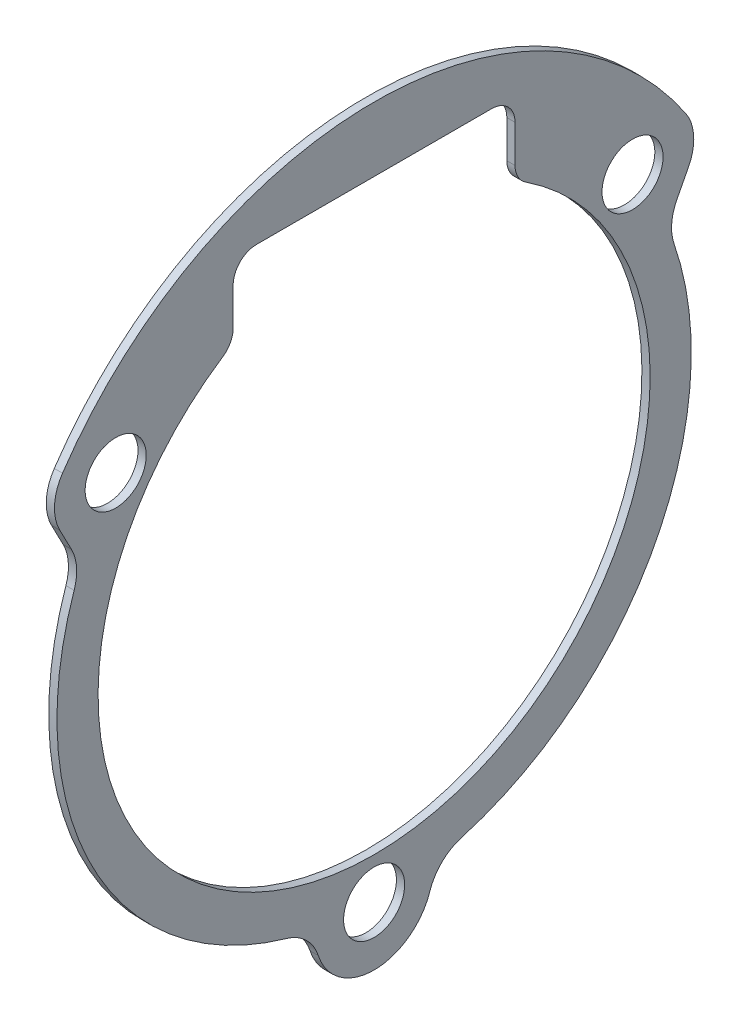
ISO-10303-21;
HEADER;
FILE_DESCRIPTION(('STEP AP214'),'2;1');
FILE_NAME('part.step','',(''),(''),'','','');
FILE_SCHEMA(('AUTOMOTIVE_DESIGN { 1 0 10303 214 1 1 1 1 }'));
ENDSEC;
DATA;
#1=APPLICATION_CONTEXT('core data for automotive mechanical design processes');
#2=APPLICATION_PROTOCOL_DEFINITION('international standard','automotive_design',2000,#1);
#3=PRODUCT_CONTEXT('',#1,'mechanical');
#4=PRODUCT('Part','Part','',(#3));
#5=PRODUCT_RELATED_PRODUCT_CATEGORY('part','',(#4));
#6=PRODUCT_DEFINITION_FORMATION('','',#4);
#7=PRODUCT_DEFINITION_CONTEXT('part definition',#1,'design');
#8=PRODUCT_DEFINITION('design','',#6,#7);
#9=PRODUCT_DEFINITION_SHAPE('','',#8);
#10=(LENGTH_UNIT() NAMED_UNIT(*) SI_UNIT(.MILLI.,.METRE.));
#11=(NAMED_UNIT(*) PLANE_ANGLE_UNIT() SI_UNIT($,.RADIAN.));
#12=(NAMED_UNIT(*) SI_UNIT($,.STERADIAN.) SOLID_ANGLE_UNIT());
#13=UNCERTAINTY_MEASURE_WITH_UNIT(LENGTH_MEASURE(1.E-05),#10,'distance_accuracy_value','');
#14=(GEOMETRIC_REPRESENTATION_CONTEXT(3) GLOBAL_UNCERTAINTY_ASSIGNED_CONTEXT((#13)) GLOBAL_UNIT_ASSIGNED_CONTEXT((#10,
#11,#12)) REPRESENTATION_CONTEXT('',''));
#15=CARTESIAN_POINT('',(0.,0.,0.));
#16=DIRECTION('',(0.,0.,1.));
#17=DIRECTION('',(1.,0.,0.));
#18=AXIS2_PLACEMENT_3D('',#15,#16,#17);
#19=CARTESIAN_POINT('',(0.35,0.,0.));
#20=DIRECTION('',(1.,0.,0.));
#21=DIRECTION('',(0.,0.,-1.));
#22=AXIS2_PLACEMENT_3D('',#19,#20,#21);
#23=PLANE('',#22);
#24=CARTESIAN_POINT('',(0.35,7.82908075667287,11.));
#25=DIRECTION('',(1.,0.,0.));
#26=DIRECTION('',(0.,0.,-1.));
#27=AXIS2_PLACEMENT_3D('',#24,#25,#26);
#28=CIRCLE('',#27,1.3);
#29=CARTESIAN_POINT('',(0.35,7.82908075667287,9.7));
#30=VERTEX_POINT('',#29);
#31=EDGE_CURVE('E610',#30,#30,#28,.T.);
#32=ORIENTED_EDGE('',*,*,#31,.F.);
#33=EDGE_LOOP('',(#32));
#34=FACE_BOUND('',#33,.T.);
#35=CARTESIAN_POINT('',(0.35,0.,0.));
#36=DIRECTION('',(1.,0.,0.));
#37=DIRECTION('',(0.,0.,-1.));
#38=AXIS2_PLACEMENT_3D('',#35,#36,#37);
#39=CIRCLE('',#38,11.75);
#40=CARTESIAN_POINT('',(0.35,9.82076127293642,6.45098039215686));
#41=VERTEX_POINT('',#40);
#42=CARTESIAN_POINT('',(0.35,9.82076127293642,-6.45098039215686));
#43=VERTEX_POINT('',#42);
#44=EDGE_CURVE('E212',#41,#43,#39,.T.);
#45=ORIENTED_EDGE('',*,*,#44,.F.);
#46=CARTESIAN_POINT('',(0.35,10.6565707429736,7.));
#47=DIRECTION('',(-1.,0.,0.));
#48=DIRECTION('',(0.,0.,1.));
#49=AXIS2_PLACEMENT_3D('',#46,#47,#48);
#50=CIRCLE('',#49,1.);
#51=CARTESIAN_POINT('',(0.35,10.6565707429736,6.));
#52=VERTEX_POINT('',#51);
#53=EDGE_CURVE('E183',#52,#41,#50,.T.);
#54=ORIENTED_EDGE('',*,*,#53,.F.);
#55=DIRECTION('',(0.,-1.,0.));
#56=VECTOR('',#55,1.);
#57=CARTESIAN_POINT('',(0.35,12.25,6.));
#58=LINE('',#57,#56);
#59=CARTESIAN_POINT('',(0.35,12.25,6.));
#60=VERTEX_POINT('',#59);
#61=EDGE_CURVE('E224',#60,#52,#58,.T.);
#62=ORIENTED_EDGE('',*,*,#61,.F.);
#63=CARTESIAN_POINT('',(0.35,12.25,5.));
#64=DIRECTION('',(1.,0.,0.));
#65=DIRECTION('',(0.,0.,-1.));
#66=AXIS2_PLACEMENT_3D('',#63,#64,#65);
#67=CIRCLE('',#66,1.);
#68=CARTESIAN_POINT('',(0.35,13.25,5.));
#69=VERTEX_POINT('',#68);
#70=EDGE_CURVE('E222',#69,#60,#67,.T.);
#71=ORIENTED_EDGE('',*,*,#70,.F.);
#72=DIRECTION('',(0.,0.,1.));
#73=VECTOR('',#72,1.);
#74=CARTESIAN_POINT('',(0.35,13.25,5.));
#75=LINE('',#74,#73);
#76=CARTESIAN_POINT('',(0.35,13.25,-5.));
#77=VERTEX_POINT('',#76);
#78=EDGE_CURVE('E220',#77,#69,#75,.T.);
#79=ORIENTED_EDGE('',*,*,#78,.F.);
#80=CARTESIAN_POINT('',(0.35,12.25,-5.));
#81=DIRECTION('',(1.,0.,0.));
#82=DIRECTION('',(0.,0.,-1.));
#83=AXIS2_PLACEMENT_3D('',#80,#81,#82);
#84=CIRCLE('',#83,1.);
#85=CARTESIAN_POINT('',(0.35,12.25,-6.));
#86=VERTEX_POINT('',#85);
#87=EDGE_CURVE('E218',#86,#77,#84,.T.);
#88=ORIENTED_EDGE('',*,*,#87,.F.);
#89=DIRECTION('',(0.,1.,0.));
#90=VECTOR('',#89,1.);
#91=CARTESIAN_POINT('',(0.35,12.25,-6.));
#92=LINE('',#91,#90);
#93=CARTESIAN_POINT('',(0.35,10.6565707429736,-6.));
#94=VERTEX_POINT('',#93);
#95=EDGE_CURVE('E216',#94,#86,#92,.T.);
#96=ORIENTED_EDGE('',*,*,#95,.F.);
#97=CARTESIAN_POINT('',(0.35,10.6565707429736,-7.));
#98=DIRECTION('',(-1.,0.,0.));
#99=DIRECTION('',(0.,0.,1.));
#100=AXIS2_PLACEMENT_3D('',#97,#98,#99);
#101=CIRCLE('',#100,1.);
#102=EDGE_CURVE('E214',#43,#94,#101,.T.);
#103=ORIENTED_EDGE('',*,*,#102,.F.);
#104=EDGE_LOOP('',(#45,#54,#62,#71,#79,#88,#96,#103));
#105=FACE_BOUND('',#104,.T.);
#106=CARTESIAN_POINT('',(0.35,0.,0.));
#107=DIRECTION('',(1.,0.,0.));
#108=DIRECTION('',(0.,0.,-1.));
#109=AXIS2_PLACEMENT_3D('',#106,#107,#108);
#110=CIRCLE('',#109,13.5);
#111=CARTESIAN_POINT('',(0.35,-12.9756578800261,-3.72589621172095));
#112=VERTEX_POINT('',#111);
#113=CARTESIAN_POINT('',(0.35,4.38237926775433,-12.7688978362879));
#114=VERTEX_POINT('',#113);
#115=EDGE_CURVE('E262',#112,#114,#110,.T.);
#116=ORIENTED_EDGE('',*,*,#115,.T.);
#117=CARTESIAN_POINT('',(0.35,5.03162064075497,-14.6605864046268));
#118=DIRECTION('',(-1.,0.,0.));
#119=DIRECTION('',(0.,0.,1.));
#120=AXIS2_PLACEMENT_3D('',#117,#118,#119);
#121=CIRCLE('',#120,2.);
#122=CARTESIAN_POINT('',(0.35,5.95357068977068,-12.8857601857761));
#123=VERTEX_POINT('',#122);
#124=EDGE_CURVE('E265',#114,#123,#121,.T.);
#125=ORIENTED_EDGE('',*,*,#124,.T.);
#126=DIRECTION('',(0.,0.887413109425359,-0.460975024507854));
#127=VECTOR('',#126,1.);
#128=CARTESIAN_POINT('',(0.35,5.95357068977068,-12.8857601857761));
#129=LINE('',#128,#127);
#130=CARTESIAN_POINT('',(0.35,6.90713070765717,-13.3810958394263));
#131=VERTEX_POINT('',#130);
#132=EDGE_CURVE('E267',#123,#131,#129,.T.);
#133=ORIENTED_EDGE('',*,*,#132,.T.);
#134=CARTESIAN_POINT('',(0.35,7.82908075667287,-11.6062696205755));
#135=DIRECTION('',(1.,0.,0.));
#136=DIRECTION('',(0.,0.,1.));
#137=AXIS2_PLACEMENT_3D('',#134,#135,#136);
#138=CIRCLE('',#137,2.);
#139=CARTESIAN_POINT('',(0.35,8.947520864769,-13.2643081378006));
#140=VERTEX_POINT('',#139);
#141=EDGE_CURVE('E269',#131,#140,#138,.T.);
#142=ORIENTED_EDGE('',*,*,#141,.T.);
#143=CARTESIAN_POINT('',(0.35,0.,0.));
#144=DIRECTION('',(1.,0.,0.));
#145=DIRECTION('',(0.,0.,-1.));
#146=AXIS2_PLACEMENT_3D('',#143,#144,#145);
#147=CIRCLE('',#146,16.);
#148=CARTESIAN_POINT('',(0.35,8.947520864769,13.2643081378006));
#149=VERTEX_POINT('',#148);
#150=EDGE_CURVE('E271',#140,#149,#147,.T.);
#151=ORIENTED_EDGE('',*,*,#150,.T.);
#152=CARTESIAN_POINT('',(0.35,7.82908075667287,11.6062696205755));
#153=DIRECTION('',(1.,0.,0.));
#154=DIRECTION('',(0.,0.,1.));
#155=AXIS2_PLACEMENT_3D('',#152,#153,#154);
#156=CIRCLE('',#155,2.);
#157=CARTESIAN_POINT('',(0.35,6.90713070765717,13.3810958394263));
#158=VERTEX_POINT('',#157);
#159=EDGE_CURVE('E273',#149,#158,#156,.T.);
#160=ORIENTED_EDGE('',*,*,#159,.T.);
#161=DIRECTION('',(0.,-0.887413109425361,-0.46097502450785));
#162=VECTOR('',#161,1.);
#163=CARTESIAN_POINT('',(0.35,5.95357068977068,12.8857601857761));
#164=LINE('',#163,#162);
#165=CARTESIAN_POINT('',(0.35,5.95357068977068,12.8857601857761));
#166=VERTEX_POINT('',#165);
#167=EDGE_CURVE('E275',#158,#166,#164,.T.);
#168=ORIENTED_EDGE('',*,*,#167,.T.);
#169=CARTESIAN_POINT('',(0.35,5.03162064075497,14.6605864046268));
#170=DIRECTION('',(-1.,0.,0.));
#171=DIRECTION('',(0.,0.,-1.));
#172=AXIS2_PLACEMENT_3D('',#169,#170,#171);
#173=CIRCLE('',#172,2.);
#174=CARTESIAN_POINT('',(0.35,4.38237926775433,12.7688978362879));
#175=VERTEX_POINT('',#174);
#176=EDGE_CURVE('E277',#166,#175,#173,.T.);
#177=ORIENTED_EDGE('',*,*,#176,.T.);
#178=CARTESIAN_POINT('',(0.35,0.,0.));
#179=DIRECTION('',(1.,0.,0.));
#180=DIRECTION('',(0.,0.,-1.));
#181=AXIS2_PLACEMENT_3D('',#178,#179,#180);
#182=CIRCLE('',#181,13.5);
#183=CARTESIAN_POINT('',(0.35,-12.9756578800261,3.72589621172096));
#184=VERTEX_POINT('',#183);
#185=EDGE_CURVE('E279',#175,#184,#182,.T.);
#186=ORIENTED_EDGE('',*,*,#185,.T.);
#187=CARTESIAN_POINT('',(0.35,-14.8979775659559,4.27788083567961));
#188=DIRECTION('',(-1.,0.,0.));
#189=DIRECTION('',(0.,0.,-1.));
#190=AXIS2_PLACEMENT_3D('',#187,#188,#189);
#191=CIRCLE('',#190,2.);
#192=CARTESIAN_POINT('',(0.35,-14.2773867593216,2.37660046426645));
#193=VERTEX_POINT('',#192);
#194=EDGE_CURVE('E281',#184,#193,#191,.T.);
#195=ORIENTED_EDGE('',*,*,#194,.T.);
#196=CARTESIAN_POINT('',(0.35,-13.5016482510287,0.));
#197=DIRECTION('',(1.,0.,0.));
#198=DIRECTION('',(0.,0.,-1.));
#199=AXIS2_PLACEMENT_3D('',#196,#197,#198);
#200=CIRCLE('',#199,2.5);
#201=CARTESIAN_POINT('',(0.35,-14.2773867593216,-2.37660046426645));
#202=VERTEX_POINT('',#201);
#203=EDGE_CURVE('E283',#193,#202,#200,.T.);
#204=ORIENTED_EDGE('',*,*,#203,.T.);
#205=CARTESIAN_POINT('',(0.35,-14.8979775659559,-4.27788083567961));
#206=DIRECTION('',(-1.,0.,0.));
#207=DIRECTION('',(0.,0.,-1.));
#208=AXIS2_PLACEMENT_3D('',#205,#206,#207);
#209=CIRCLE('',#208,2.);
#210=EDGE_CURVE('E285',#202,#112,#209,.T.);
#211=ORIENTED_EDGE('',*,*,#210,.T.);
#212=EDGE_LOOP('',(#116,#125,#133,#142,#151,#160,#168,#177,#186,#195,#204,#211));
#213=FACE_BOUND('',#212,.T.);
#214=CARTESIAN_POINT('',(0.35,7.82908075667287,-11.));
#215=DIRECTION('',(1.,0.,0.));
#216=DIRECTION('',(0.,0.,-1.));
#217=AXIS2_PLACEMENT_3D('',#214,#215,#216);
#218=CIRCLE('',#217,1.3);
#219=CARTESIAN_POINT('',(0.35,7.82908075667287,-12.3));
#220=VERTEX_POINT('',#219);
#221=EDGE_CURVE('E191',#220,#220,#218,.T.);
#222=ORIENTED_EDGE('',*,*,#221,.F.);
#223=EDGE_LOOP('',(#222));
#224=FACE_BOUND('',#223,.T.);
#225=CARTESIAN_POINT('',(0.35,-13.5016482510287,0.));
#226=DIRECTION('',(1.,0.,0.));
#227=DIRECTION('',(0.,0.,-1.));
#228=AXIS2_PLACEMENT_3D('',#225,#226,#227);
#229=CIRCLE('',#228,1.3);
#230=CARTESIAN_POINT('',(0.35,-13.5016482510287,-1.3));
#231=VERTEX_POINT('',#230);
#232=EDGE_CURVE('E599',#231,#231,#229,.T.);
#233=ORIENTED_EDGE('',*,*,#232,.F.);
#234=EDGE_LOOP('',(#233));
#235=FACE_BOUND('',#234,.T.);
#236=ADVANCED_FACE('F31',(#34,#105,#213,#224,#235),#23,.T.);
#237=CARTESIAN_POINT('',(0.,0.,0.));
#238=DIRECTION('',(1.,0.,0.));
#239=DIRECTION('',(0.,0.,-1.));
#240=AXIS2_PLACEMENT_3D('',#237,#238,#239);
#241=PLANE('',#240);
#242=CARTESIAN_POINT('',(0.,7.82908075667287,11.));
#243=DIRECTION('',(1.,0.,0.));
#244=DIRECTION('',(0.,0.,-1.));
#245=AXIS2_PLACEMENT_3D('',#242,#243,#244);
#246=CIRCLE('',#245,1.3);
#247=CARTESIAN_POINT('',(0.,7.82908075667287,9.7));
#248=VERTEX_POINT('',#247);
#249=EDGE_CURVE('E605',#248,#248,#246,.T.);
#250=ORIENTED_EDGE('',*,*,#249,.T.);
#251=EDGE_LOOP('',(#250));
#252=FACE_BOUND('',#251,.T.);
#253=CARTESIAN_POINT('',(0.,10.6565707429736,7.));
#254=DIRECTION('',(-1.,0.,0.));
#255=DIRECTION('',(0.,0.,1.));
#256=AXIS2_PLACEMENT_3D('',#253,#254,#255);
#257=CIRCLE('',#256,1.);
#258=CARTESIAN_POINT('',(0.,10.6565707429736,6.));
#259=VERTEX_POINT('',#258);
#260=CARTESIAN_POINT('',(0.,9.82076127293642,6.45098039215686));
#261=VERTEX_POINT('',#260);
#262=EDGE_CURVE('E54',#259,#261,#257,.T.);
#263=ORIENTED_EDGE('',*,*,#262,.T.);
#264=CARTESIAN_POINT('',(0.,0.,0.));
#265=DIRECTION('',(1.,0.,0.));
#266=DIRECTION('',(0.,0.,-1.));
#267=AXIS2_PLACEMENT_3D('',#264,#265,#266);
#268=CIRCLE('',#267,11.75);
#269=CARTESIAN_POINT('',(0.,9.82076127293642,-6.45098039215686));
#270=VERTEX_POINT('',#269);
#271=EDGE_CURVE('E170',#261,#270,#268,.T.);
#272=ORIENTED_EDGE('',*,*,#271,.T.);
#273=CARTESIAN_POINT('',(0.,10.6565707429736,-7.));
#274=DIRECTION('',(-1.,0.,0.));
#275=DIRECTION('',(0.,0.,1.));
#276=AXIS2_PLACEMENT_3D('',#273,#274,#275);
#277=CIRCLE('',#276,1.);
#278=CARTESIAN_POINT('',(0.,10.6565707429736,-6.));
#279=VERTEX_POINT('',#278);
#280=EDGE_CURVE('E179',#270,#279,#277,.T.);
#281=ORIENTED_EDGE('',*,*,#280,.T.);
#282=DIRECTION('',(0.,1.,0.));
#283=VECTOR('',#282,1.);
#284=CARTESIAN_POINT('',(0.,12.25,-6.));
#285=LINE('',#284,#283);
#286=CARTESIAN_POINT('',(0.,12.25,-6.));
#287=VERTEX_POINT('',#286);
#288=EDGE_CURVE('E199',#279,#287,#285,.T.);
#289=ORIENTED_EDGE('',*,*,#288,.T.);
#290=CARTESIAN_POINT('',(0.,12.25,-5.));
#291=DIRECTION('',(1.,0.,0.));
#292=DIRECTION('',(0.,0.,-1.));
#293=AXIS2_PLACEMENT_3D('',#290,#291,#292);
#294=CIRCLE('',#293,1.);
#295=CARTESIAN_POINT('',(0.,13.25,-5.));
#296=VERTEX_POINT('',#295);
#297=EDGE_CURVE('E202',#287,#296,#294,.T.);
#298=ORIENTED_EDGE('',*,*,#297,.T.);
#299=DIRECTION('',(0.,0.,1.));
#300=VECTOR('',#299,1.);
#301=CARTESIAN_POINT('',(0.,13.25,5.));
#302=LINE('',#301,#300);
#303=CARTESIAN_POINT('',(0.,13.25,5.));
#304=VERTEX_POINT('',#303);
#305=EDGE_CURVE('E205',#296,#304,#302,.T.);
#306=ORIENTED_EDGE('',*,*,#305,.T.);
#307=CARTESIAN_POINT('',(0.,12.25,5.));
#308=DIRECTION('',(1.,0.,0.));
#309=DIRECTION('',(0.,0.,-1.));
#310=AXIS2_PLACEMENT_3D('',#307,#308,#309);
#311=CIRCLE('',#310,1.);
#312=CARTESIAN_POINT('',(0.,12.25,6.));
#313=VERTEX_POINT('',#312);
#314=EDGE_CURVE('E208',#304,#313,#311,.T.);
#315=ORIENTED_EDGE('',*,*,#314,.T.);
#316=DIRECTION('',(0.,-1.,0.));
#317=VECTOR('',#316,1.);
#318=CARTESIAN_POINT('',(0.,12.25,6.));
#319=LINE('',#318,#317);
#320=EDGE_CURVE('E190',#313,#259,#319,.T.);
#321=ORIENTED_EDGE('',*,*,#320,.T.);
#322=EDGE_LOOP('',(#263,#272,#281,#289,#298,#306,#315,#321));
#323=FACE_BOUND('',#322,.T.);
#324=CARTESIAN_POINT('',(0.,0.,0.));
#325=DIRECTION('',(1.,0.,0.));
#326=DIRECTION('',(0.,0.,-1.));
#327=AXIS2_PLACEMENT_3D('',#324,#325,#326);
#328=CIRCLE('',#327,13.5);
#329=CARTESIAN_POINT('',(0.,-12.9756578800261,-3.72589621172095));
#330=VERTEX_POINT('',#329);
#331=CARTESIAN_POINT('',(0.,4.38237926775433,-12.7688978362879));
#332=VERTEX_POINT('',#331);
#333=EDGE_CURVE('E184',#330,#332,#328,.T.);
#334=ORIENTED_EDGE('',*,*,#333,.F.);
#335=CARTESIAN_POINT('',(0.,-14.8979775659559,-4.27788083567961));
#336=DIRECTION('',(-1.,0.,0.));
#337=DIRECTION('',(0.,0.,-1.));
#338=AXIS2_PLACEMENT_3D('',#335,#336,#337);
#339=CIRCLE('',#338,2.);
#340=CARTESIAN_POINT('',(0.,-14.2773867593216,-2.37660046426645));
#341=VERTEX_POINT('',#340);
#342=EDGE_CURVE('E260',#341,#330,#339,.T.);
#343=ORIENTED_EDGE('',*,*,#342,.F.);
#344=CARTESIAN_POINT('',(0.,-13.5016482510287,0.));
#345=DIRECTION('',(1.,0.,0.));
#346=DIRECTION('',(0.,0.,-1.));
#347=AXIS2_PLACEMENT_3D('',#344,#345,#346);
#348=CIRCLE('',#347,2.5);
#349=CARTESIAN_POINT('',(0.,-14.2773867593216,2.37660046426645));
#350=VERTEX_POINT('',#349);
#351=EDGE_CURVE('E258',#350,#341,#348,.T.);
#352=ORIENTED_EDGE('',*,*,#351,.F.);
#353=CARTESIAN_POINT('',(0.,-14.8979775659559,4.27788083567961));
#354=DIRECTION('',(-1.,0.,0.));
#355=DIRECTION('',(0.,0.,-1.));
#356=AXIS2_PLACEMENT_3D('',#353,#354,#355);
#357=CIRCLE('',#356,2.);
#358=CARTESIAN_POINT('',(0.,-12.9756578800261,3.72589621172096));
#359=VERTEX_POINT('',#358);
#360=EDGE_CURVE('E256',#359,#350,#357,.T.);
#361=ORIENTED_EDGE('',*,*,#360,.F.);
#362=CARTESIAN_POINT('',(0.,0.,0.));
#363=DIRECTION('',(1.,0.,0.));
#364=DIRECTION('',(0.,0.,-1.));
#365=AXIS2_PLACEMENT_3D('',#362,#363,#364);
#366=CIRCLE('',#365,13.5);
#367=CARTESIAN_POINT('',(0.,4.38237926775433,12.7688978362879));
#368=VERTEX_POINT('',#367);
#369=EDGE_CURVE('E254',#368,#359,#366,.T.);
#370=ORIENTED_EDGE('',*,*,#369,.F.);
#371=CARTESIAN_POINT('',(0.,5.03162064075497,14.6605864046268));
#372=DIRECTION('',(-1.,0.,0.));
#373=DIRECTION('',(0.,0.,-1.));
#374=AXIS2_PLACEMENT_3D('',#371,#372,#373);
#375=CIRCLE('',#374,2.);
#376=CARTESIAN_POINT('',(0.,5.95357068977068,12.8857601857761));
#377=VERTEX_POINT('',#376);
#378=EDGE_CURVE('E252',#377,#368,#375,.T.);
#379=ORIENTED_EDGE('',*,*,#378,.F.);
#380=DIRECTION('',(0.,-0.887413109425361,-0.46097502450785));
#381=VECTOR('',#380,1.);
#382=CARTESIAN_POINT('',(0.,5.95357068977068,12.8857601857761));
#383=LINE('',#382,#381);
#384=CARTESIAN_POINT('',(0.,6.90713070765717,13.3810958394263));
#385=VERTEX_POINT('',#384);
#386=EDGE_CURVE('E250',#385,#377,#383,.T.);
#387=ORIENTED_EDGE('',*,*,#386,.F.);
#388=CARTESIAN_POINT('',(0.,7.82908075667287,11.6062696205755));
#389=DIRECTION('',(1.,0.,0.));
#390=DIRECTION('',(0.,0.,1.));
#391=AXIS2_PLACEMENT_3D('',#388,#389,#390);
#392=CIRCLE('',#391,2.);
#393=CARTESIAN_POINT('',(0.,8.947520864769,13.2643081378006));
#394=VERTEX_POINT('',#393);
#395=EDGE_CURVE('E248',#394,#385,#392,.T.);
#396=ORIENTED_EDGE('',*,*,#395,.F.);
#397=CARTESIAN_POINT('',(0.,0.,0.));
#398=DIRECTION('',(1.,0.,0.));
#399=DIRECTION('',(0.,0.,-1.));
#400=AXIS2_PLACEMENT_3D('',#397,#398,#399);
#401=CIRCLE('',#400,16.);
#402=CARTESIAN_POINT('',(0.,8.947520864769,-13.2643081378006));
#403=VERTEX_POINT('',#402);
#404=EDGE_CURVE('E246',#403,#394,#401,.T.);
#405=ORIENTED_EDGE('',*,*,#404,.F.);
#406=CARTESIAN_POINT('',(0.,7.82908075667287,-11.6062696205755));
#407=DIRECTION('',(1.,0.,0.));
#408=DIRECTION('',(0.,0.,1.));
#409=AXIS2_PLACEMENT_3D('',#406,#407,#408);
#410=CIRCLE('',#409,2.);
#411=CARTESIAN_POINT('',(0.,6.90713070765717,-13.3810958394263));
#412=VERTEX_POINT('',#411);
#413=EDGE_CURVE('E244',#412,#403,#410,.T.);
#414=ORIENTED_EDGE('',*,*,#413,.F.);
#415=DIRECTION('',(0.,0.887413109425359,-0.460975024507854));
#416=VECTOR('',#415,1.);
#417=CARTESIAN_POINT('',(0.,5.95357068977068,-12.8857601857761));
#418=LINE('',#417,#416);
#419=CARTESIAN_POINT('',(0.,5.95357068977068,-12.8857601857761));
#420=VERTEX_POINT('',#419);
#421=EDGE_CURVE('E242',#420,#412,#418,.T.);
#422=ORIENTED_EDGE('',*,*,#421,.F.);
#423=CARTESIAN_POINT('',(0.,5.03162064075497,-14.6605864046268));
#424=DIRECTION('',(-1.,0.,0.));
#425=DIRECTION('',(0.,0.,1.));
#426=AXIS2_PLACEMENT_3D('',#423,#424,#425);
#427=CIRCLE('',#426,2.);
#428=EDGE_CURVE('E240',#332,#420,#427,.T.);
#429=ORIENTED_EDGE('',*,*,#428,.F.);
#430=EDGE_LOOP('',(#334,#343,#352,#361,#370,#379,#387,#396,#405,#414,#422,#429));
#431=FACE_BOUND('',#430,.T.);
#432=CARTESIAN_POINT('',(0.,7.82908075667287,-11.));
#433=DIRECTION('',(1.,0.,0.));
#434=DIRECTION('',(0.,0.,-1.));
#435=AXIS2_PLACEMENT_3D('',#432,#433,#434);
#436=CIRCLE('',#435,1.3);
#437=CARTESIAN_POINT('',(0.,7.82908075667287,-12.3));
#438=VERTEX_POINT('',#437);
#439=EDGE_CURVE('E194',#438,#438,#436,.T.);
#440=ORIENTED_EDGE('',*,*,#439,.T.);
#441=EDGE_LOOP('',(#440));
#442=FACE_BOUND('',#441,.T.);
#443=CARTESIAN_POINT('',(0.,-13.5016482510287,0.));
#444=DIRECTION('',(1.,0.,0.));
#445=DIRECTION('',(0.,0.,-1.));
#446=AXIS2_PLACEMENT_3D('',#443,#444,#445);
#447=CIRCLE('',#446,1.3);
#448=CARTESIAN_POINT('',(0.,-13.5016482510287,-1.3));
#449=VERTEX_POINT('',#448);
#450=EDGE_CURVE('E602',#449,#449,#447,.T.);
#451=ORIENTED_EDGE('',*,*,#450,.T.);
#452=EDGE_LOOP('',(#451));
#453=FACE_BOUND('',#452,.T.);
#454=ADVANCED_FACE('F187',(#252,#323,#431,#442,#453),#241,.F.);
#455=CARTESIAN_POINT('',(0.35,0.,0.));
#456=DIRECTION('',(-1.,0.,0.));
#457=DIRECTION('',(0.,0.,1.));
#458=AXIS2_PLACEMENT_3D('',#455,#456,#457);
#459=CYLINDRICAL_SURFACE('',#458,13.5);
#460=ORIENTED_EDGE('',*,*,#333,.T.);
#461=DIRECTION('',(-1.,0.,0.));
#462=VECTOR('',#461,1.);
#463=CARTESIAN_POINT('',(0.35,4.38237926775433,-12.7688978362879));
#464=LINE('',#463,#462);
#465=EDGE_CURVE('E11',#114,#332,#464,.T.);
#466=ORIENTED_EDGE('',*,*,#465,.F.);
#467=ORIENTED_EDGE('',*,*,#115,.F.);
#468=DIRECTION('',(-1.,0.,0.));
#469=VECTOR('',#468,1.);
#470=CARTESIAN_POINT('',(0.35,-12.9756578800261,-3.72589621172095));
#471=LINE('',#470,#469);
#472=EDGE_CURVE('E287',#112,#330,#471,.T.);
#473=ORIENTED_EDGE('',*,*,#472,.T.);
#474=EDGE_LOOP('',(#460,#466,#467,#473));
#475=FACE_BOUND('',#474,.T.);
#476=ADVANCED_FACE('F33',(#475),#459,.T.);
#477=CARTESIAN_POINT('',(0.35,5.03162064075497,-14.6605864046268));
#478=DIRECTION('',(-1.,0.,0.));
#479=DIRECTION('',(0.,0.,1.));
#480=AXIS2_PLACEMENT_3D('',#477,#478,#479);
#481=CYLINDRICAL_SURFACE('',#480,2.);
#482=ORIENTED_EDGE('',*,*,#428,.T.);
#483=DIRECTION('',(-1.,0.,0.));
#484=VECTOR('',#483,1.);
#485=CARTESIAN_POINT('',(0.35,5.95357068977068,-12.8857601857761));
#486=LINE('',#485,#484);
#487=EDGE_CURVE('E39',#123,#420,#486,.T.);
#488=ORIENTED_EDGE('',*,*,#487,.F.);
#489=ORIENTED_EDGE('',*,*,#124,.F.);
#490=ORIENTED_EDGE('',*,*,#465,.T.);
#491=EDGE_LOOP('',(#482,#488,#489,#490));
#492=FACE_BOUND('',#491,.T.);
#493=ADVANCED_FACE('F343',(#492),#481,.F.);
#494=CARTESIAN_POINT('',(0.35,5.95357068977068,-12.8857601857761));
#495=DIRECTION('',(0.,0.460975024507854,0.887413109425359));
#496=DIRECTION('',(0.,-0.887413109425359,0.460975024507854));
#497=AXIS2_PLACEMENT_3D('',#494,#495,#496);
#498=PLANE('',#497);
#499=ORIENTED_EDGE('',*,*,#421,.T.);
#500=DIRECTION('',(-1.,0.,0.));
#501=VECTOR('',#500,1.);
#502=CARTESIAN_POINT('',(0.35,6.90713070765717,-13.3810958394263));
#503=LINE('',#502,#501);
#504=EDGE_CURVE('E314',#131,#412,#503,.T.);
#505=ORIENTED_EDGE('',*,*,#504,.F.);
#506=ORIENTED_EDGE('',*,*,#132,.F.);
#507=ORIENTED_EDGE('',*,*,#487,.T.);
#508=EDGE_LOOP('',(#499,#505,#506,#507));
#509=FACE_BOUND('',#508,.T.);
#510=ADVANCED_FACE('F321',(#509),#498,.F.);
#511=CARTESIAN_POINT('',(0.35,7.82908075667287,-11.6062696205755));
#512=DIRECTION('',(-1.,0.,0.));
#513=DIRECTION('',(0.,0.,1.));
#514=AXIS2_PLACEMENT_3D('',#511,#512,#513);
#515=CYLINDRICAL_SURFACE('',#514,2.);
#516=ORIENTED_EDGE('',*,*,#413,.T.);
#517=DIRECTION('',(-1.,0.,0.));
#518=VECTOR('',#517,1.);
#519=CARTESIAN_POINT('',(0.35,8.947520864769,-13.2643081378006));
#520=LINE('',#519,#518);
#521=EDGE_CURVE('E311',#140,#403,#520,.T.);
#522=ORIENTED_EDGE('',*,*,#521,.F.);
#523=ORIENTED_EDGE('',*,*,#141,.F.);
#524=ORIENTED_EDGE('',*,*,#504,.T.);
#525=EDGE_LOOP('',(#516,#522,#523,#524));
#526=FACE_BOUND('',#525,.T.);
#527=ADVANCED_FACE('F331',(#526),#515,.T.);
#528=CARTESIAN_POINT('',(0.35,0.,0.));
#529=DIRECTION('',(-1.,0.,0.));
#530=DIRECTION('',(0.,0.,1.));
#531=AXIS2_PLACEMENT_3D('',#528,#529,#530);
#532=CYLINDRICAL_SURFACE('',#531,16.);
#533=ORIENTED_EDGE('',*,*,#404,.T.);
#534=DIRECTION('',(-1.,0.,0.));
#535=VECTOR('',#534,1.);
#536=CARTESIAN_POINT('',(0.35,8.947520864769,13.2643081378006));
#537=LINE('',#536,#535);
#538=EDGE_CURVE('E308',#149,#394,#537,.T.);
#539=ORIENTED_EDGE('',*,*,#538,.F.);
#540=ORIENTED_EDGE('',*,*,#150,.F.);
#541=ORIENTED_EDGE('',*,*,#521,.T.);
#542=EDGE_LOOP('',(#533,#539,#540,#541));
#543=FACE_BOUND('',#542,.T.);
#544=ADVANCED_FACE('F335',(#543),#532,.T.);
#545=CARTESIAN_POINT('',(0.35,7.82908075667287,11.6062696205755));
#546=DIRECTION('',(-1.,0.,0.));
#547=DIRECTION('',(0.,0.,1.));
#548=AXIS2_PLACEMENT_3D('',#545,#546,#547);
#549=CYLINDRICAL_SURFACE('',#548,2.);
#550=ORIENTED_EDGE('',*,*,#395,.T.);
#551=DIRECTION('',(-1.,0.,0.));
#552=VECTOR('',#551,1.);
#553=CARTESIAN_POINT('',(0.35,6.90713070765717,13.3810958394263));
#554=LINE('',#553,#552);
#555=EDGE_CURVE('E305',#158,#385,#554,.T.);
#556=ORIENTED_EDGE('',*,*,#555,.F.);
#557=ORIENTED_EDGE('',*,*,#159,.F.);
#558=ORIENTED_EDGE('',*,*,#538,.T.);
#559=EDGE_LOOP('',(#550,#556,#557,#558));
#560=FACE_BOUND('',#559,.T.);
#561=ADVANCED_FACE('F376',(#560),#549,.T.);
#562=CARTESIAN_POINT('',(0.35,5.95357068977068,12.8857601857761));
#563=DIRECTION('',(0.,0.460975024507849,-0.887413109425361));
#564=DIRECTION('',(0.,0.887413109425361,0.460975024507849));
#565=AXIS2_PLACEMENT_3D('',#562,#563,#564);
#566=PLANE('',#565);
#567=ORIENTED_EDGE('',*,*,#386,.T.);
#568=DIRECTION('',(-1.,0.,0.));
#569=VECTOR('',#568,1.);
#570=CARTESIAN_POINT('',(0.35,5.95357068977068,12.8857601857761));
#571=LINE('',#570,#569);
#572=EDGE_CURVE('E302',#166,#377,#571,.T.);
#573=ORIENTED_EDGE('',*,*,#572,.F.);
#574=ORIENTED_EDGE('',*,*,#167,.F.);
#575=ORIENTED_EDGE('',*,*,#555,.T.);
#576=EDGE_LOOP('',(#567,#573,#574,#575));
#577=FACE_BOUND('',#576,.T.);
#578=ADVANCED_FACE('F374',(#577),#566,.F.);
#579=CARTESIAN_POINT('',(0.35,5.03162064075497,14.6605864046268));
#580=DIRECTION('',(-1.,0.,0.));
#581=DIRECTION('',(0.,0.,1.));
#582=AXIS2_PLACEMENT_3D('',#579,#580,#581);
#583=CYLINDRICAL_SURFACE('',#582,2.);
#584=ORIENTED_EDGE('',*,*,#378,.T.);
#585=DIRECTION('',(-1.,0.,0.));
#586=VECTOR('',#585,1.);
#587=CARTESIAN_POINT('',(0.35,4.38237926775433,12.7688978362879));
#588=LINE('',#587,#586);
#589=EDGE_CURVE('E299',#175,#368,#588,.T.);
#590=ORIENTED_EDGE('',*,*,#589,.F.);
#591=ORIENTED_EDGE('',*,*,#176,.F.);
#592=ORIENTED_EDGE('',*,*,#572,.T.);
#593=EDGE_LOOP('',(#584,#590,#591,#592));
#594=FACE_BOUND('',#593,.T.);
#595=ADVANCED_FACE('F370',(#594),#583,.F.);
#596=CARTESIAN_POINT('',(0.35,0.,0.));
#597=DIRECTION('',(-1.,0.,0.));
#598=DIRECTION('',(0.,0.,1.));
#599=AXIS2_PLACEMENT_3D('',#596,#597,#598);
#600=CYLINDRICAL_SURFACE('',#599,13.5);
#601=ORIENTED_EDGE('',*,*,#369,.T.);
#602=DIRECTION('',(-1.,0.,0.));
#603=VECTOR('',#602,1.);
#604=CARTESIAN_POINT('',(0.35,-12.9756578800261,3.72589621172096));
#605=LINE('',#604,#603);
#606=EDGE_CURVE('E296',#184,#359,#605,.T.);
#607=ORIENTED_EDGE('',*,*,#606,.F.);
#608=ORIENTED_EDGE('',*,*,#185,.F.);
#609=ORIENTED_EDGE('',*,*,#589,.T.);
#610=EDGE_LOOP('',(#601,#607,#608,#609));
#611=FACE_BOUND('',#610,.T.);
#612=ADVANCED_FACE('F365',(#611),#600,.T.);
#613=CARTESIAN_POINT('',(0.35,-14.8979775659559,4.27788083567961));
#614=DIRECTION('',(-1.,0.,0.));
#615=DIRECTION('',(0.,0.,1.));
#616=AXIS2_PLACEMENT_3D('',#613,#614,#615);
#617=CYLINDRICAL_SURFACE('',#616,2.);
#618=ORIENTED_EDGE('',*,*,#360,.T.);
#619=DIRECTION('',(-1.,0.,0.));
#620=VECTOR('',#619,1.);
#621=CARTESIAN_POINT('',(0.35,-14.2773867593216,2.37660046426645));
#622=LINE('',#621,#620);
#623=EDGE_CURVE('E293',#193,#350,#622,.T.);
#624=ORIENTED_EDGE('',*,*,#623,.F.);
#625=ORIENTED_EDGE('',*,*,#194,.F.);
#626=ORIENTED_EDGE('',*,*,#606,.T.);
#627=EDGE_LOOP('',(#618,#624,#625,#626));
#628=FACE_BOUND('',#627,.T.);
#629=ADVANCED_FACE('F359',(#628),#617,.F.);
#630=CARTESIAN_POINT('',(0.35,-13.5016482510287,0.));
#631=DIRECTION('',(-1.,0.,0.));
#632=DIRECTION('',(0.,0.,1.));
#633=AXIS2_PLACEMENT_3D('',#630,#631,#632);
#634=CYLINDRICAL_SURFACE('',#633,2.5);
#635=ORIENTED_EDGE('',*,*,#351,.T.);
#636=DIRECTION('',(-1.,0.,0.));
#637=VECTOR('',#636,1.);
#638=CARTESIAN_POINT('',(0.35,-14.2773867593216,-2.37660046426645));
#639=LINE('',#638,#637);
#640=EDGE_CURVE('E290',#202,#341,#639,.T.);
#641=ORIENTED_EDGE('',*,*,#640,.F.);
#642=ORIENTED_EDGE('',*,*,#203,.F.);
#643=ORIENTED_EDGE('',*,*,#623,.T.);
#644=EDGE_LOOP('',(#635,#641,#642,#643));
#645=FACE_BOUND('',#644,.T.);
#646=ADVANCED_FACE('F355',(#645),#634,.T.);
#647=CARTESIAN_POINT('',(0.35,-14.8979775659559,-4.27788083567961));
#648=DIRECTION('',(-1.,0.,0.));
#649=DIRECTION('',(0.,0.,1.));
#650=AXIS2_PLACEMENT_3D('',#647,#648,#649);
#651=CYLINDRICAL_SURFACE('',#650,2.);
#652=ORIENTED_EDGE('',*,*,#342,.T.);
#653=ORIENTED_EDGE('',*,*,#472,.F.);
#654=ORIENTED_EDGE('',*,*,#210,.F.);
#655=ORIENTED_EDGE('',*,*,#640,.T.);
#656=EDGE_LOOP('',(#652,#653,#654,#655));
#657=FACE_BOUND('',#656,.T.);
#658=ADVANCED_FACE('F350',(#657),#651,.F.);
#659=CARTESIAN_POINT('',(0.35,10.6565707429736,7.));
#660=DIRECTION('',(-1.,0.,0.));
#661=DIRECTION('',(0.,0.,1.));
#662=AXIS2_PLACEMENT_3D('',#659,#660,#661);
#663=CYLINDRICAL_SURFACE('',#662,1.);
#664=ORIENTED_EDGE('',*,*,#262,.F.);
#665=DIRECTION('',(-1.,0.,0.));
#666=VECTOR('',#665,1.);
#667=CARTESIAN_POINT('',(0.35,10.6565707429736,6.));
#668=LINE('',#667,#666);
#669=EDGE_CURVE('E226',#52,#259,#668,.T.);
#670=ORIENTED_EDGE('',*,*,#669,.F.);
#671=ORIENTED_EDGE('',*,*,#53,.T.);
#672=DIRECTION('',(-1.,0.,0.));
#673=VECTOR('',#672,1.);
#674=CARTESIAN_POINT('',(0.35,9.82076127293642,6.45098039215686));
#675=LINE('',#674,#673);
#676=EDGE_CURVE('E172',#41,#261,#675,.T.);
#677=ORIENTED_EDGE('',*,*,#676,.T.);
#678=EDGE_LOOP('',(#664,#670,#671,#677));
#679=FACE_BOUND('',#678,.T.);
#680=ADVANCED_FACE('F181',(#679),#663,.T.);
#681=CARTESIAN_POINT('',(0.35,0.,0.));
#682=DIRECTION('',(-1.,0.,0.));
#683=DIRECTION('',(0.,0.,1.));
#684=AXIS2_PLACEMENT_3D('',#681,#682,#683);
#685=CYLINDRICAL_SURFACE('',#684,11.75);
#686=ORIENTED_EDGE('',*,*,#271,.F.);
#687=ORIENTED_EDGE('',*,*,#676,.F.);
#688=ORIENTED_EDGE('',*,*,#44,.T.);
#689=DIRECTION('',(-1.,0.,0.));
#690=VECTOR('',#689,1.);
#691=CARTESIAN_POINT('',(0.35,9.82076127293642,-6.45098039215686));
#692=LINE('',#691,#690);
#693=EDGE_CURVE('E175',#43,#270,#692,.T.);
#694=ORIENTED_EDGE('',*,*,#693,.T.);
#695=EDGE_LOOP('',(#686,#687,#688,#694));
#696=FACE_BOUND('',#695,.T.);
#697=ADVANCED_FACE('F171',(#696),#685,.F.);
#698=CARTESIAN_POINT('',(0.35,10.6565707429736,-7.));
#699=DIRECTION('',(-1.,0.,0.));
#700=DIRECTION('',(0.,0.,1.));
#701=AXIS2_PLACEMENT_3D('',#698,#699,#700);
#702=CYLINDRICAL_SURFACE('',#701,1.);
#703=ORIENTED_EDGE('',*,*,#280,.F.);
#704=ORIENTED_EDGE('',*,*,#693,.F.);
#705=ORIENTED_EDGE('',*,*,#102,.T.);
#706=DIRECTION('',(-1.,0.,0.));
#707=VECTOR('',#706,1.);
#708=CARTESIAN_POINT('',(0.35,10.6565707429736,-6.));
#709=LINE('',#708,#707);
#710=EDGE_CURVE('E235',#94,#279,#709,.T.);
#711=ORIENTED_EDGE('',*,*,#710,.T.);
#712=EDGE_LOOP('',(#703,#704,#705,#711));
#713=FACE_BOUND('',#712,.T.);
#714=ADVANCED_FACE('F437',(#713),#702,.T.);
#715=CARTESIAN_POINT('',(0.35,12.25,-6.));
#716=DIRECTION('',(0.,0.,1.));
#717=DIRECTION('',(0.,-1.,0.));
#718=AXIS2_PLACEMENT_3D('',#715,#716,#717);
#719=PLANE('',#718);
#720=ORIENTED_EDGE('',*,*,#288,.F.);
#721=ORIENTED_EDGE('',*,*,#710,.F.);
#722=ORIENTED_EDGE('',*,*,#95,.T.);
#723=DIRECTION('',(-1.,0.,0.));
#724=VECTOR('',#723,1.);
#725=CARTESIAN_POINT('',(0.35,12.25,-6.));
#726=LINE('',#725,#724);
#727=EDGE_CURVE('E233',#86,#287,#726,.T.);
#728=ORIENTED_EDGE('',*,*,#727,.T.);
#729=EDGE_LOOP('',(#720,#721,#722,#728));
#730=FACE_BOUND('',#729,.T.);
#731=ADVANCED_FACE('F444',(#730),#719,.T.);
#732=CARTESIAN_POINT('',(0.35,12.25,-5.));
#733=DIRECTION('',(-1.,0.,0.));
#734=DIRECTION('',(0.,0.,1.));
#735=AXIS2_PLACEMENT_3D('',#732,#733,#734);
#736=CYLINDRICAL_SURFACE('',#735,1.);
#737=ORIENTED_EDGE('',*,*,#297,.F.);
#738=ORIENTED_EDGE('',*,*,#727,.F.);
#739=ORIENTED_EDGE('',*,*,#87,.T.);
#740=DIRECTION('',(-1.,0.,0.));
#741=VECTOR('',#740,1.);
#742=CARTESIAN_POINT('',(0.35,13.25,-5.));
#743=LINE('',#742,#741);
#744=EDGE_CURVE('E231',#77,#296,#743,.T.);
#745=ORIENTED_EDGE('',*,*,#744,.T.);
#746=EDGE_LOOP('',(#737,#738,#739,#745));
#747=FACE_BOUND('',#746,.T.);
#748=ADVANCED_FACE('F452',(#747),#736,.F.);
#749=CARTESIAN_POINT('',(0.35,13.25,5.));
#750=DIRECTION('',(0.,-1.,0.));
#751=DIRECTION('',(0.,0.,-1.));
#752=AXIS2_PLACEMENT_3D('',#749,#750,#751);
#753=PLANE('',#752);
#754=ORIENTED_EDGE('',*,*,#305,.F.);
#755=ORIENTED_EDGE('',*,*,#744,.F.);
#756=ORIENTED_EDGE('',*,*,#78,.T.);
#757=DIRECTION('',(-1.,0.,0.));
#758=VECTOR('',#757,1.);
#759=CARTESIAN_POINT('',(0.35,13.25,5.));
#760=LINE('',#759,#758);
#761=EDGE_CURVE('E229',#69,#304,#760,.T.);
#762=ORIENTED_EDGE('',*,*,#761,.T.);
#763=EDGE_LOOP('',(#754,#755,#756,#762));
#764=FACE_BOUND('',#763,.T.);
#765=ADVANCED_FACE('F460',(#764),#753,.T.);
#766=CARTESIAN_POINT('',(0.35,12.25,5.));
#767=DIRECTION('',(-1.,0.,0.));
#768=DIRECTION('',(0.,0.,1.));
#769=AXIS2_PLACEMENT_3D('',#766,#767,#768);
#770=CYLINDRICAL_SURFACE('',#769,1.);
#771=ORIENTED_EDGE('',*,*,#314,.F.);
#772=ORIENTED_EDGE('',*,*,#761,.F.);
#773=ORIENTED_EDGE('',*,*,#70,.T.);
#774=DIRECTION('',(-1.,0.,0.));
#775=VECTOR('',#774,1.);
#776=CARTESIAN_POINT('',(0.35,12.25,6.));
#777=LINE('',#776,#775);
#778=EDGE_CURVE('E46',#60,#313,#777,.T.);
#779=ORIENTED_EDGE('',*,*,#778,.T.);
#780=EDGE_LOOP('',(#771,#772,#773,#779));
#781=FACE_BOUND('',#780,.T.);
#782=ADVANCED_FACE('F468',(#781),#770,.F.);
#783=CARTESIAN_POINT('',(0.35,12.25,6.));
#784=DIRECTION('',(0.,0.,-1.));
#785=DIRECTION('',(0.,1.,0.));
#786=AXIS2_PLACEMENT_3D('',#783,#784,#785);
#787=PLANE('',#786);
#788=ORIENTED_EDGE('',*,*,#320,.F.);
#789=ORIENTED_EDGE('',*,*,#778,.F.);
#790=ORIENTED_EDGE('',*,*,#61,.T.);
#791=ORIENTED_EDGE('',*,*,#669,.T.);
#792=EDGE_LOOP('',(#788,#789,#790,#791));
#793=FACE_BOUND('',#792,.T.);
#794=ADVANCED_FACE('F476',(#793),#787,.T.);
#795=CARTESIAN_POINT('',(0.35,7.82908075667287,-11.));
#796=DIRECTION('',(-1.,0.,0.));
#797=DIRECTION('',(0.,0.,1.));
#798=AXIS2_PLACEMENT_3D('',#795,#796,#797);
#799=CYLINDRICAL_SURFACE('',#798,1.3);
#800=ORIENTED_EDGE('',*,*,#221,.T.);
#801=EDGE_LOOP('',(#800));
#802=FACE_BOUND('',#801,.T.);
#803=ORIENTED_EDGE('',*,*,#439,.F.);
#804=EDGE_LOOP('',(#803));
#805=FACE_BOUND('',#804,.T.);
#806=ADVANCED_FACE('F484',(#802,#805),#799,.F.);
#807=CARTESIAN_POINT('',(0.35,7.82908075667287,11.));
#808=DIRECTION('',(-1.,0.,0.));
#809=DIRECTION('',(0.,0.,1.));
#810=AXIS2_PLACEMENT_3D('',#807,#808,#809);
#811=CYLINDRICAL_SURFACE('',#810,1.3);
#812=ORIENTED_EDGE('',*,*,#31,.T.);
#813=EDGE_LOOP('',(#812));
#814=FACE_BOUND('',#813,.T.);
#815=ORIENTED_EDGE('',*,*,#249,.F.);
#816=EDGE_LOOP('',(#815));
#817=FACE_BOUND('',#816,.T.);
#818=ADVANCED_FACE('F491',(#814,#817),#811,.F.);
#819=CARTESIAN_POINT('',(0.35,-13.5016482510287,0.));
#820=DIRECTION('',(-1.,0.,0.));
#821=DIRECTION('',(0.,0.,1.));
#822=AXIS2_PLACEMENT_3D('',#819,#820,#821);
#823=CYLINDRICAL_SURFACE('',#822,1.3);
#824=ORIENTED_EDGE('',*,*,#232,.T.);
#825=EDGE_LOOP('',(#824));
#826=FACE_BOUND('',#825,.T.);
#827=ORIENTED_EDGE('',*,*,#450,.F.);
#828=EDGE_LOOP('',(#827));
#829=FACE_BOUND('',#828,.T.);
#830=ADVANCED_FACE('F499',(#826,#829),#823,.F.);
#831=CLOSED_SHELL('',(#236,#454,#476,#493,#510,#527,#544,#561,#578,#595,#612,#629,#646,#658,
#680,#697,#714,#731,#748,#765,#782,#794,#806,#818,#830));
#832=MANIFOLD_SOLID_BREP('B2',#831);
#833=ADVANCED_BREP_SHAPE_REPRESENTATION('',(#18,#832),#14);
#834=SHAPE_DEFINITION_REPRESENTATION(#9,#833);
ENDSEC;
END-ISO-10303-21;
